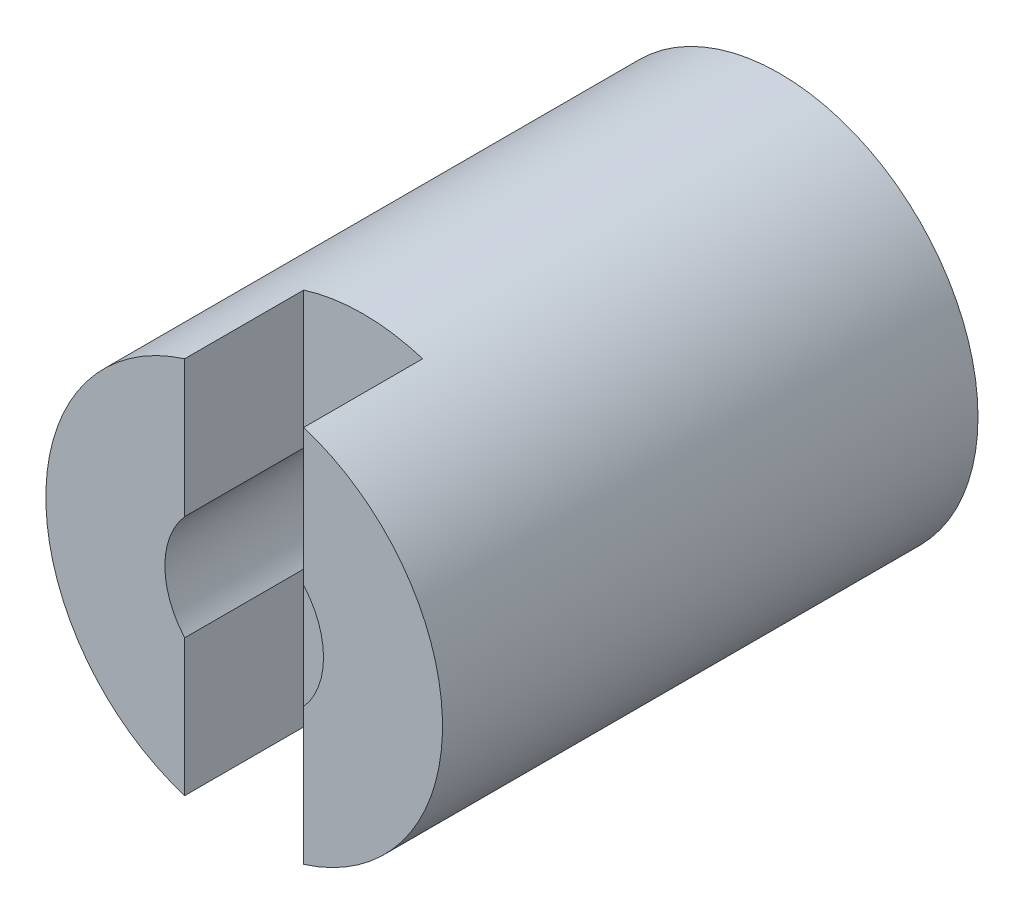
ISO-10303-21;
HEADER;
FILE_DESCRIPTION(('STEP AP214'),'2;1');
FILE_NAME('part.step','',(''),(''),'','','');
FILE_SCHEMA(('AUTOMOTIVE_DESIGN { 1 0 10303 214 1 1 1 1 }'));
ENDSEC;
DATA;
#1=APPLICATION_CONTEXT('core data for automotive mechanical design processes');
#2=APPLICATION_PROTOCOL_DEFINITION('international standard','automotive_design',2000,#1);
#3=PRODUCT_CONTEXT('',#1,'mechanical');
#4=PRODUCT('Part','Part','',(#3));
#5=PRODUCT_RELATED_PRODUCT_CATEGORY('part','',(#4));
#6=PRODUCT_DEFINITION_FORMATION('','',#4);
#7=PRODUCT_DEFINITION_CONTEXT('part definition',#1,'design');
#8=PRODUCT_DEFINITION('design','',#6,#7);
#9=PRODUCT_DEFINITION_SHAPE('','',#8);
#10=(LENGTH_UNIT() NAMED_UNIT(*) SI_UNIT(.MILLI.,.METRE.));
#11=(NAMED_UNIT(*) PLANE_ANGLE_UNIT() SI_UNIT($,.RADIAN.));
#12=(NAMED_UNIT(*) SI_UNIT($,.STERADIAN.) SOLID_ANGLE_UNIT());
#13=UNCERTAINTY_MEASURE_WITH_UNIT(LENGTH_MEASURE(1.E-05),#10,'distance_accuracy_value','');
#14=(GEOMETRIC_REPRESENTATION_CONTEXT(3) GLOBAL_UNCERTAINTY_ASSIGNED_CONTEXT((#13)) GLOBAL_UNIT_ASSIGNED_CONTEXT((#10,
#11,#12)) REPRESENTATION_CONTEXT('',''));
#15=CARTESIAN_POINT('',(0.,0.,0.));
#16=DIRECTION('',(0.,0.,1.));
#17=DIRECTION('',(1.,0.,0.));
#18=AXIS2_PLACEMENT_3D('',#15,#16,#17);
#19=CARTESIAN_POINT('',(0.,0.,27.));
#20=DIRECTION('',(0.,0.,1.));
#21=DIRECTION('',(1.,0.,0.));
#22=AXIS2_PLACEMENT_3D('',#19,#20,#21);
#23=PLANE('',#22);
#24=DIRECTION('',(0.,1.,0.));
#25=VECTOR('',#24,1.);
#26=CARTESIAN_POINT('',(3.,0.,27.));
#27=LINE('',#26,#25);
#28=CARTESIAN_POINT('',(3.,-9.53939201416946,27.));
#29=VERTEX_POINT('',#28);
#30=CARTESIAN_POINT('',(3.,-2.64575131106459,27.));
#31=VERTEX_POINT('',#30);
#32=EDGE_CURVE('E207',#29,#31,#27,.T.);
#33=ORIENTED_EDGE('',*,*,#32,.F.);
#34=CARTESIAN_POINT('',(0.,0.,27.));
#35=DIRECTION('',(0.,0.,1.));
#36=DIRECTION('',(1.,0.,0.));
#37=AXIS2_PLACEMENT_3D('',#34,#35,#36);
#38=CIRCLE('',#37,10.);
#39=CARTESIAN_POINT('',(3.,9.53939201416945,27.));
#40=VERTEX_POINT('',#39);
#41=EDGE_CURVE('E193',#29,#40,#38,.T.);
#42=ORIENTED_EDGE('',*,*,#41,.T.);
#43=CARTESIAN_POINT('',(3.,2.64575131106458,27.));
#44=VERTEX_POINT('',#43);
#45=EDGE_CURVE('E205',#44,#40,#27,.T.);
#46=ORIENTED_EDGE('',*,*,#45,.F.);
#47=CARTESIAN_POINT('',(0.,0.,27.));
#48=DIRECTION('',(0.,0.,1.));
#49=DIRECTION('',(1.,0.,0.));
#50=AXIS2_PLACEMENT_3D('',#47,#48,#49);
#51=CIRCLE('',#50,4.);
#52=EDGE_CURVE('E189',#31,#44,#51,.T.);
#53=ORIENTED_EDGE('',*,*,#52,.F.);
#54=EDGE_LOOP('',(#33,#42,#46,#53));
#55=FACE_BOUND('',#54,.T.);
#56=ADVANCED_FACE('F30',(#55),#23,.T.);
#57=CARTESIAN_POINT('',(0.,0.,-113.));
#58=DIRECTION('',(0.,0.,1.));
#59=DIRECTION('',(1.,0.,0.));
#60=AXIS2_PLACEMENT_3D('',#57,#58,#59);
#61=CYLINDRICAL_SURFACE('',#60,4.);
#62=CARTESIAN_POINT('',(0.,0.,21.));
#63=DIRECTION('',(0.,0.,-1.));
#64=DIRECTION('',(-1.,0.,0.));
#65=AXIS2_PLACEMENT_3D('',#62,#63,#64);
#66=CIRCLE('',#65,4.);
#67=CARTESIAN_POINT('',(-3.,-2.64575131106459,21.));
#68=VERTEX_POINT('',#67);
#69=CARTESIAN_POINT('',(3.,-2.64575131106459,21.));
#70=VERTEX_POINT('',#69);
#71=EDGE_CURVE('E183',#68,#70,#66,.F.);
#72=ORIENTED_EDGE('',*,*,#71,.T.);
#73=DIRECTION('',(0.,0.,1.));
#74=VECTOR('',#73,1.);
#75=CARTESIAN_POINT('',(3.,-2.64575131106459,-113.));
#76=LINE('',#75,#74);
#77=EDGE_CURVE('E174',#70,#31,#76,.T.);
#78=ORIENTED_EDGE('',*,*,#77,.T.);
#79=ORIENTED_EDGE('',*,*,#52,.T.);
#80=DIRECTION('',(0.,0.,1.));
#81=VECTOR('',#80,1.);
#82=CARTESIAN_POINT('',(3.,2.64575131106459,-113.));
#83=LINE('',#82,#81);
#84=CARTESIAN_POINT('',(3.,2.64575131106459,21.));
#85=VERTEX_POINT('',#84);
#86=EDGE_CURVE('E177',#44,#85,#83,.F.);
#87=ORIENTED_EDGE('',*,*,#86,.T.);
#88=CARTESIAN_POINT('',(-3.,2.64575131106459,21.));
#89=VERTEX_POINT('',#88);
#90=EDGE_CURVE('E180',#85,#89,#66,.F.);
#91=ORIENTED_EDGE('',*,*,#90,.T.);
#92=DIRECTION('',(0.,0.,1.));
#93=VECTOR('',#92,1.);
#94=CARTESIAN_POINT('',(-3.,2.64575131106459,-113.));
#95=LINE('',#94,#93);
#96=CARTESIAN_POINT('',(-3.,2.64575131106458,27.));
#97=VERTEX_POINT('',#96);
#98=EDGE_CURVE('E162',#89,#97,#95,.T.);
#99=ORIENTED_EDGE('',*,*,#98,.T.);
#100=CARTESIAN_POINT('',(-3.,-2.64575131106459,27.));
#101=VERTEX_POINT('',#100);
#102=EDGE_CURVE('E192',#97,#101,#51,.T.);
#103=ORIENTED_EDGE('',*,*,#102,.T.);
#104=DIRECTION('',(0.,0.,1.));
#105=VECTOR('',#104,1.);
#106=CARTESIAN_POINT('',(-3.,-2.64575131106459,-113.));
#107=LINE('',#106,#105);
#108=EDGE_CURVE('E165',#101,#68,#107,.F.);
#109=ORIENTED_EDGE('',*,*,#108,.T.);
#110=EDGE_LOOP('',(#72,#78,#79,#87,#91,#99,#103,#109));
#111=FACE_BOUND('',#110,.T.);
#112=CARTESIAN_POINT('',(0.,0.,15.));
#113=DIRECTION('',(0.,0.,-1.));
#114=DIRECTION('',(-1.,0.,0.));
#115=AXIS2_PLACEMENT_3D('',#112,#113,#114);
#116=CIRCLE('',#115,4.);
#117=CARTESIAN_POINT('',(-4.,0.,15.));
#118=VERTEX_POINT('',#117);
#119=EDGE_CURVE('E186',#118,#118,#116,.F.);
#120=ORIENTED_EDGE('',*,*,#119,.F.);
#121=EDGE_LOOP('',(#120));
#122=FACE_BOUND('',#121,.T.);
#123=ADVANCED_FACE('F227',(#111,#122),#61,.F.);
#124=CARTESIAN_POINT('',(0.,0.,27.));
#125=DIRECTION('',(0.,0.,-1.));
#126=DIRECTION('',(-1.,0.,0.));
#127=AXIS2_PLACEMENT_3D('',#124,#125,#126);
#128=CYLINDRICAL_SURFACE('',#127,10.);
#129=CARTESIAN_POINT('',(0.,0.,21.));
#130=DIRECTION('',(0.,0.,-1.));
#131=DIRECTION('',(-1.,0.,0.));
#132=AXIS2_PLACEMENT_3D('',#129,#130,#131);
#133=CIRCLE('',#132,10.);
#134=CARTESIAN_POINT('',(-3.,9.53939201416946,21.));
#135=VERTEX_POINT('',#134);
#136=CARTESIAN_POINT('',(3.,9.53939201416946,21.));
#137=VERTEX_POINT('',#136);
#138=EDGE_CURVE('E210',#135,#137,#133,.T.);
#139=ORIENTED_EDGE('',*,*,#138,.T.);
#140=DIRECTION('',(0.,0.,-1.));
#141=VECTOR('',#140,1.);
#142=CARTESIAN_POINT('',(3.,9.53939201416946,27.));
#143=LINE('',#142,#141);
#144=EDGE_CURVE('E168',#137,#40,#143,.F.);
#145=ORIENTED_EDGE('',*,*,#144,.T.);
#146=ORIENTED_EDGE('',*,*,#41,.F.);
#147=DIRECTION('',(0.,0.,-1.));
#148=VECTOR('',#147,1.);
#149=CARTESIAN_POINT('',(3.,-9.53939201416946,27.));
#150=LINE('',#149,#148);
#151=CARTESIAN_POINT('',(3.,-9.53939201416946,21.));
#152=VERTEX_POINT('',#151);
#153=EDGE_CURVE('E171',#29,#152,#150,.T.);
#154=ORIENTED_EDGE('',*,*,#153,.T.);
#155=CARTESIAN_POINT('',(-3.,-9.53939201416946,21.));
#156=VERTEX_POINT('',#155);
#157=EDGE_CURVE('E208',#152,#156,#133,.T.);
#158=ORIENTED_EDGE('',*,*,#157,.T.);
#159=DIRECTION('',(0.,0.,-1.));
#160=VECTOR('',#159,1.);
#161=CARTESIAN_POINT('',(-3.,-9.53939201416946,27.));
#162=LINE('',#161,#160);
#163=CARTESIAN_POINT('',(-3.,-9.53939201416946,27.));
#164=VERTEX_POINT('',#163);
#165=EDGE_CURVE('E158',#156,#164,#162,.F.);
#166=ORIENTED_EDGE('',*,*,#165,.T.);
#167=CARTESIAN_POINT('',(-3.,9.53939201416946,27.));
#168=VERTEX_POINT('',#167);
#169=EDGE_CURVE('E196',#168,#164,#38,.T.);
#170=ORIENTED_EDGE('',*,*,#169,.F.);
#171=DIRECTION('',(0.,0.,-1.));
#172=VECTOR('',#171,1.);
#173=CARTESIAN_POINT('',(-3.,9.53939201416946,27.));
#174=LINE('',#173,#172);
#175=EDGE_CURVE('E53',#168,#135,#174,.T.);
#176=ORIENTED_EDGE('',*,*,#175,.T.);
#177=EDGE_LOOP('',(#139,#145,#146,#154,#158,#166,#170,#176));
#178=FACE_BOUND('',#177,.T.);
#179=CARTESIAN_POINT('',(0.,0.,0.));
#180=DIRECTION('',(0.,0.,1.));
#181=DIRECTION('',(1.,0.,0.));
#182=AXIS2_PLACEMENT_3D('',#179,#180,#181);
#183=CIRCLE('',#182,10.);
#184=CARTESIAN_POINT('',(10.,0.,0.));
#185=VERTEX_POINT('',#184);
#186=EDGE_CURVE('E197',#185,#185,#183,.T.);
#187=ORIENTED_EDGE('',*,*,#186,.T.);
#188=EDGE_LOOP('',(#187));
#189=FACE_BOUND('',#188,.T.);
#190=ADVANCED_FACE('F32',(#178,#189),#128,.T.);
#191=DIRECTION('',(0.,-1.,0.));
#192=VECTOR('',#191,1.);
#193=CARTESIAN_POINT('',(-3.,0.,27.));
#194=LINE('',#193,#192);
#195=EDGE_CURVE('E204',#168,#97,#194,.T.);
#196=ORIENTED_EDGE('',*,*,#195,.F.);
#197=ORIENTED_EDGE('',*,*,#169,.T.);
#198=EDGE_CURVE('E202',#101,#164,#194,.T.);
#199=ORIENTED_EDGE('',*,*,#198,.F.);
#200=ORIENTED_EDGE('',*,*,#102,.F.);
#201=EDGE_LOOP('',(#196,#197,#199,#200));
#202=FACE_BOUND('',#201,.T.);
#203=ADVANCED_FACE('F231',(#202),#23,.T.);
#204=CARTESIAN_POINT('',(0.,0.,0.));
#205=DIRECTION('',(0.,0.,1.));
#206=DIRECTION('',(1.,0.,0.));
#207=AXIS2_PLACEMENT_3D('',#204,#205,#206);
#208=PLANE('',#207);
#209=CARTESIAN_POINT('',(0.,0.,0.));
#210=DIRECTION('',(0.,0.,-1.));
#211=DIRECTION('',(-1.,0.,0.));
#212=AXIS2_PLACEMENT_3D('',#209,#210,#211);
#213=CIRCLE('',#212,6.);
#214=CARTESIAN_POINT('',(-5.45435605731786,2.5,0.));
#215=VERTEX_POINT('',#214);
#216=CARTESIAN_POINT('',(-5.45435605731786,-2.5,0.));
#217=VERTEX_POINT('',#216);
#218=EDGE_CURVE('E187',#215,#217,#213,.T.);
#219=ORIENTED_EDGE('',*,*,#218,.F.);
#220=DIRECTION('',(1.,0.,0.));
#221=VECTOR('',#220,1.);
#222=CARTESIAN_POINT('',(-3.92033539975995,2.5,0.));
#223=LINE('',#222,#221);
#224=CARTESIAN_POINT('',(-7.5,2.5,0.));
#225=VERTEX_POINT('',#224);
#226=EDGE_CURVE('E140',#225,#215,#223,.T.);
#227=ORIENTED_EDGE('',*,*,#226,.F.);
#228=DIRECTION('',(0.,1.,0.));
#229=VECTOR('',#228,1.);
#230=CARTESIAN_POINT('',(-7.5,2.5,0.));
#231=LINE('',#230,#229);
#232=CARTESIAN_POINT('',(-7.5,-2.5,0.));
#233=VERTEX_POINT('',#232);
#234=EDGE_CURVE('E131',#233,#225,#231,.T.);
#235=ORIENTED_EDGE('',*,*,#234,.F.);
#236=DIRECTION('',(-1.,0.,0.));
#237=VECTOR('',#236,1.);
#238=CARTESIAN_POINT('',(-3.92033539975995,-2.5,0.));
#239=LINE('',#238,#237);
#240=EDGE_CURVE('E121',#217,#233,#239,.T.);
#241=ORIENTED_EDGE('',*,*,#240,.F.);
#242=EDGE_LOOP('',(#219,#227,#235,#241));
#243=FACE_BOUND('',#242,.T.);
#244=ORIENTED_EDGE('',*,*,#186,.F.);
#245=EDGE_LOOP('',(#244));
#246=FACE_BOUND('',#245,.T.);
#247=ADVANCED_FACE('F142',(#243,#246),#208,.F.);
#248=CARTESIAN_POINT('',(0.,0.,15.));
#249=DIRECTION('',(0.,0.,-1.));
#250=DIRECTION('',(-1.,0.,0.));
#251=AXIS2_PLACEMENT_3D('',#248,#249,#250);
#252=PLANE('',#251);
#253=ORIENTED_EDGE('',*,*,#119,.T.);
#254=EDGE_LOOP('',(#253));
#255=FACE_BOUND('',#254,.T.);
#256=DIRECTION('',(-1.,0.,0.));
#257=VECTOR('',#256,1.);
#258=CARTESIAN_POINT('',(-3.92033539975995,2.5,15.));
#259=LINE('',#258,#257);
#260=CARTESIAN_POINT('',(-5.45435605731786,2.5,15.));
#261=VERTEX_POINT('',#260);
#262=CARTESIAN_POINT('',(-7.5,2.5,15.));
#263=VERTEX_POINT('',#262);
#264=EDGE_CURVE('E45',#261,#263,#259,.T.);
#265=ORIENTED_EDGE('',*,*,#264,.F.);
#266=CARTESIAN_POINT('',(0.,0.,15.));
#267=DIRECTION('',(0.,0.,-1.));
#268=DIRECTION('',(-1.,0.,0.));
#269=AXIS2_PLACEMENT_3D('',#266,#267,#268);
#270=CIRCLE('',#269,6.);
#271=CARTESIAN_POINT('',(-5.45435605731786,-2.5,15.));
#272=VERTEX_POINT('',#271);
#273=EDGE_CURVE('E184',#261,#272,#270,.T.);
#274=ORIENTED_EDGE('',*,*,#273,.T.);
#275=DIRECTION('',(1.,0.,0.));
#276=VECTOR('',#275,1.);
#277=CARTESIAN_POINT('',(-3.92033539975995,-2.5,15.));
#278=LINE('',#277,#276);
#279=CARTESIAN_POINT('',(-7.5,-2.5,15.));
#280=VERTEX_POINT('',#279);
#281=EDGE_CURVE('E149',#280,#272,#278,.T.);
#282=ORIENTED_EDGE('',*,*,#281,.F.);
#283=DIRECTION('',(0.,-1.,0.));
#284=VECTOR('',#283,1.);
#285=CARTESIAN_POINT('',(-7.5,2.5,15.));
#286=LINE('',#285,#284);
#287=EDGE_CURVE('E138',#263,#280,#286,.T.);
#288=ORIENTED_EDGE('',*,*,#287,.F.);
#289=EDGE_LOOP('',(#265,#274,#282,#288));
#290=FACE_BOUND('',#289,.T.);
#291=ADVANCED_FACE('F272',(#255,#290),#252,.T.);
#292=CARTESIAN_POINT('',(0.,0.,15.));
#293=DIRECTION('',(0.,0.,-1.));
#294=DIRECTION('',(-1.,0.,0.));
#295=AXIS2_PLACEMENT_3D('',#292,#293,#294);
#296=CYLINDRICAL_SURFACE('',#295,6.);
#297=ORIENTED_EDGE('',*,*,#273,.F.);
#298=DIRECTION('',(0.,0.,-1.));
#299=VECTOR('',#298,1.);
#300=CARTESIAN_POINT('',(-5.45435605731786,2.5,15.));
#301=LINE('',#300,#299);
#302=EDGE_CURVE('E11',#261,#215,#301,.T.);
#303=ORIENTED_EDGE('',*,*,#302,.T.);
#304=ORIENTED_EDGE('',*,*,#218,.T.);
#305=DIRECTION('',(0.,0.,-1.));
#306=VECTOR('',#305,1.);
#307=CARTESIAN_POINT('',(-5.45435605731786,-2.5,15.));
#308=LINE('',#307,#306);
#309=EDGE_CURVE('E38',#217,#272,#308,.F.);
#310=ORIENTED_EDGE('',*,*,#309,.T.);
#311=EDGE_LOOP('',(#297,#303,#304,#310));
#312=FACE_BOUND('',#311,.T.);
#313=ADVANCED_FACE('F260',(#312),#296,.F.);
#314=CARTESIAN_POINT('',(3.,-15.,27.));
#315=DIRECTION('',(1.,0.,0.));
#316=DIRECTION('',(0.,0.,-1.));
#317=AXIS2_PLACEMENT_3D('',#314,#315,#316);
#318=PLANE('',#317);
#319=DIRECTION('',(0.,1.,0.));
#320=VECTOR('',#319,1.);
#321=CARTESIAN_POINT('',(3.,-15.,21.));
#322=LINE('',#321,#320);
#323=EDGE_CURVE('E155',#152,#70,#322,.T.);
#324=ORIENTED_EDGE('',*,*,#323,.F.);
#325=ORIENTED_EDGE('',*,*,#153,.F.);
#326=ORIENTED_EDGE('',*,*,#32,.T.);
#327=ORIENTED_EDGE('',*,*,#77,.F.);
#328=EDGE_LOOP('',(#324,#325,#326,#327));
#329=FACE_BOUND('',#328,.T.);
#330=ADVANCED_FACE('F242',(#329),#318,.F.);
#331=CARTESIAN_POINT('',(-3.,-15.,27.));
#332=DIRECTION('',(-1.,0.,0.));
#333=DIRECTION('',(0.,0.,1.));
#334=AXIS2_PLACEMENT_3D('',#331,#332,#333);
#335=PLANE('',#334);
#336=ORIENTED_EDGE('',*,*,#198,.T.);
#337=ORIENTED_EDGE('',*,*,#165,.F.);
#338=DIRECTION('',(0.,1.,0.));
#339=VECTOR('',#338,1.);
#340=CARTESIAN_POINT('',(-3.,-15.,21.));
#341=LINE('',#340,#339);
#342=EDGE_CURVE('E154',#156,#68,#341,.T.);
#343=ORIENTED_EDGE('',*,*,#342,.T.);
#344=ORIENTED_EDGE('',*,*,#108,.F.);
#345=EDGE_LOOP('',(#336,#337,#343,#344));
#346=FACE_BOUND('',#345,.T.);
#347=ADVANCED_FACE('F234',(#346),#335,.F.);
#348=CARTESIAN_POINT('',(3.,-15.,21.));
#349=DIRECTION('',(0.,0.,-1.));
#350=DIRECTION('',(-1.,0.,0.));
#351=AXIS2_PLACEMENT_3D('',#348,#349,#350);
#352=PLANE('',#351);
#353=ORIENTED_EDGE('',*,*,#342,.F.);
#354=ORIENTED_EDGE('',*,*,#157,.F.);
#355=ORIENTED_EDGE('',*,*,#323,.T.);
#356=ORIENTED_EDGE('',*,*,#71,.F.);
#357=EDGE_LOOP('',(#353,#354,#355,#356));
#358=FACE_BOUND('',#357,.T.);
#359=ADVANCED_FACE('F240',(#358),#352,.F.);
#360=EDGE_CURVE('E151',#85,#137,#322,.T.);
#361=ORIENTED_EDGE('',*,*,#360,.T.);
#362=ORIENTED_EDGE('',*,*,#138,.F.);
#363=EDGE_CURVE('E152',#89,#135,#341,.T.);
#364=ORIENTED_EDGE('',*,*,#363,.F.);
#365=ORIENTED_EDGE('',*,*,#90,.F.);
#366=EDGE_LOOP('',(#361,#362,#364,#365));
#367=FACE_BOUND('',#366,.T.);
#368=ADVANCED_FACE('F220',(#367),#352,.F.);
#369=ORIENTED_EDGE('',*,*,#45,.T.);
#370=ORIENTED_EDGE('',*,*,#144,.F.);
#371=ORIENTED_EDGE('',*,*,#360,.F.);
#372=ORIENTED_EDGE('',*,*,#86,.F.);
#373=EDGE_LOOP('',(#369,#370,#371,#372));
#374=FACE_BOUND('',#373,.T.);
#375=ADVANCED_FACE('F248',(#374),#318,.F.);
#376=ORIENTED_EDGE('',*,*,#363,.T.);
#377=ORIENTED_EDGE('',*,*,#175,.F.);
#378=ORIENTED_EDGE('',*,*,#195,.T.);
#379=ORIENTED_EDGE('',*,*,#98,.F.);
#380=EDGE_LOOP('',(#376,#377,#378,#379));
#381=FACE_BOUND('',#380,.T.);
#382=ADVANCED_FACE('F222',(#381),#335,.F.);
#383=CARTESIAN_POINT('',(-3.92033539975995,2.5,21.1493087945079));
#384=DIRECTION('',(0.,1.,0.));
#385=DIRECTION('',(0.,0.,1.));
#386=AXIS2_PLACEMENT_3D('',#383,#384,#385);
#387=PLANE('',#386);
#388=ORIENTED_EDGE('',*,*,#264,.T.);
#389=DIRECTION('',(0.,0.,-1.));
#390=VECTOR('',#389,1.);
#391=CARTESIAN_POINT('',(-7.5,2.5,21.1493087945079));
#392=LINE('',#391,#390);
#393=EDGE_CURVE('E139',#263,#225,#392,.T.);
#394=ORIENTED_EDGE('',*,*,#393,.T.);
#395=ORIENTED_EDGE('',*,*,#226,.T.);
#396=ORIENTED_EDGE('',*,*,#302,.F.);
#397=EDGE_LOOP('',(#388,#394,#395,#396));
#398=FACE_BOUND('',#397,.T.);
#399=ADVANCED_FACE('F255',(#398),#387,.F.);
#400=CARTESIAN_POINT('',(-3.92033539975995,-2.5,21.1493087945079));
#401=DIRECTION('',(0.,-1.,0.));
#402=DIRECTION('',(0.,0.,-1.));
#403=AXIS2_PLACEMENT_3D('',#400,#401,#402);
#404=PLANE('',#403);
#405=ORIENTED_EDGE('',*,*,#240,.T.);
#406=DIRECTION('',(0.,0.,-1.));
#407=VECTOR('',#406,1.);
#408=CARTESIAN_POINT('',(-7.5,-2.5,21.1493087945079));
#409=LINE('',#408,#407);
#410=EDGE_CURVE('E124',#280,#233,#409,.T.);
#411=ORIENTED_EDGE('',*,*,#410,.F.);
#412=ORIENTED_EDGE('',*,*,#281,.T.);
#413=ORIENTED_EDGE('',*,*,#309,.F.);
#414=EDGE_LOOP('',(#405,#411,#412,#413));
#415=FACE_BOUND('',#414,.T.);
#416=ADVANCED_FACE('F123',(#415),#404,.F.);
#417=CARTESIAN_POINT('',(-7.5,2.5,21.1493087945079));
#418=DIRECTION('',(-1.,0.,0.));
#419=DIRECTION('',(0.,0.,1.));
#420=AXIS2_PLACEMENT_3D('',#417,#418,#419);
#421=PLANE('',#420);
#422=ORIENTED_EDGE('',*,*,#287,.T.);
#423=ORIENTED_EDGE('',*,*,#410,.T.);
#424=ORIENTED_EDGE('',*,*,#234,.T.);
#425=ORIENTED_EDGE('',*,*,#393,.F.);
#426=EDGE_LOOP('',(#422,#423,#424,#425));
#427=FACE_BOUND('',#426,.T.);
#428=ADVANCED_FACE('F135',(#427),#421,.F.);
#429=CLOSED_SHELL('',(#56,#123,#190,#203,#247,#291,#313,#330,#347,#359,#368,#375,#382,#399,#416,#428));
#430=MANIFOLD_SOLID_BREP('B2',#429);
#431=ADVANCED_BREP_SHAPE_REPRESENTATION('',(#18,#430),#14);
#432=SHAPE_DEFINITION_REPRESENTATION(#9,#431);
ENDSEC;
END-ISO-10303-21;
